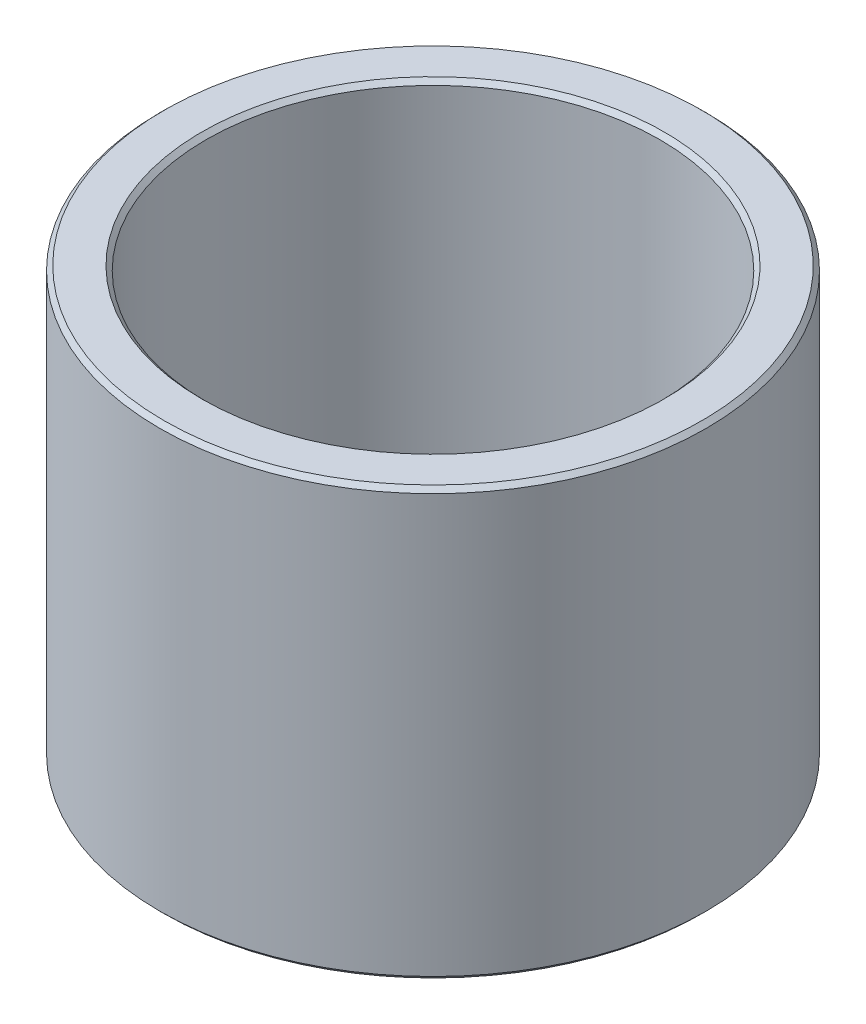
ISO-10303-21;
HEADER;
FILE_DESCRIPTION(('STEP AP214'),'2;1');
FILE_NAME('part.step','',(''),(''),'','','');
FILE_SCHEMA(('AUTOMOTIVE_DESIGN { 1 0 10303 214 1 1 1 1 }'));
ENDSEC;
DATA;
#1=APPLICATION_CONTEXT('core data for automotive mechanical design processes');
#2=APPLICATION_PROTOCOL_DEFINITION('international standard','automotive_design',2000,#1);
#3=PRODUCT_CONTEXT('',#1,'mechanical');
#4=PRODUCT('Part','Part','',(#3));
#5=PRODUCT_RELATED_PRODUCT_CATEGORY('part','',(#4));
#6=PRODUCT_DEFINITION_FORMATION('','',#4);
#7=PRODUCT_DEFINITION_CONTEXT('part definition',#1,'design');
#8=PRODUCT_DEFINITION('design','',#6,#7);
#9=PRODUCT_DEFINITION_SHAPE('','',#8);
#10=(LENGTH_UNIT() NAMED_UNIT(*) SI_UNIT(.MILLI.,.METRE.));
#11=(NAMED_UNIT(*) PLANE_ANGLE_UNIT() SI_UNIT($,.RADIAN.));
#12=(NAMED_UNIT(*) SI_UNIT($,.STERADIAN.) SOLID_ANGLE_UNIT());
#13=UNCERTAINTY_MEASURE_WITH_UNIT(LENGTH_MEASURE(1.E-05),#10,'distance_accuracy_value','');
#14=(GEOMETRIC_REPRESENTATION_CONTEXT(3) GLOBAL_UNCERTAINTY_ASSIGNED_CONTEXT((#13)) GLOBAL_UNIT_ASSIGNED_CONTEXT((#10,
#11,#12)) REPRESENTATION_CONTEXT('',''));
#15=CARTESIAN_POINT('',(0.,0.,0.));
#16=DIRECTION('',(0.,0.,1.));
#17=DIRECTION('',(1.,0.,0.));
#18=AXIS2_PLACEMENT_3D('',#15,#16,#17);
#19=CARTESIAN_POINT('',(0.,66.3926313848611,0.));
#20=DIRECTION('',(0.,-1.,0.));
#21=DIRECTION('',(0.,0.,-1.));
#22=AXIS2_PLACEMENT_3D('',#19,#20,#21);
#23=CYLINDRICAL_SURFACE('',#22,42.5);
#24=CARTESIAN_POINT('',(0.,0.686489548159461,0.));
#25=DIRECTION('',(0.,1.,0.));
#26=DIRECTION('',(0.,0.,1.));
#27=AXIS2_PLACEMENT_3D('',#24,#25,#26);
#28=CIRCLE('',#27,42.5);
#29=CARTESIAN_POINT('',(0.,0.686489548159461,42.5));
#30=VERTEX_POINT('',#29);
#31=EDGE_CURVE('E10',#30,#30,#28,.T.);
#32=ORIENTED_EDGE('',*,*,#31,.T.);
#33=EDGE_LOOP('',(#32));
#34=FACE_BOUND('',#33,.T.);
#35=CARTESIAN_POINT('',(0.,65.7061418367016,0.));
#36=DIRECTION('',(0.,1.,0.));
#37=DIRECTION('',(0.,0.,1.));
#38=AXIS2_PLACEMENT_3D('',#35,#36,#37);
#39=CIRCLE('',#38,42.5);
#40=CARTESIAN_POINT('',(0.,65.7061418367016,42.5));
#41=VERTEX_POINT('',#40);
#42=EDGE_CURVE('E50',#41,#41,#39,.F.);
#43=ORIENTED_EDGE('',*,*,#42,.T.);
#44=EDGE_LOOP('',(#43));
#45=FACE_BOUND('',#44,.T.);
#46=ADVANCED_FACE('F39',(#34,#45),#23,.T.);
#47=CARTESIAN_POINT('',(0.,66.3926313848611,0.));
#48=DIRECTION('',(0.,1.,0.));
#49=DIRECTION('',(0.,0.,1.));
#50=AXIS2_PLACEMENT_3D('',#47,#48,#49);
#51=PLANE('',#50);
#52=CARTESIAN_POINT('',(0.,66.3926313848611,0.));
#53=DIRECTION('',(0.,1.,0.));
#54=DIRECTION('',(0.,0.,1.));
#55=AXIS2_PLACEMENT_3D('',#52,#53,#54);
#56=CIRCLE('',#55,35.9613486154048);
#57=CARTESIAN_POINT('',(0.,66.3926313848611,35.9613486154048));
#58=VERTEX_POINT('',#57);
#59=EDGE_CURVE('E58',#58,#58,#56,.F.);
#60=ORIENTED_EDGE('',*,*,#59,.T.);
#61=EDGE_LOOP('',(#60));
#62=FACE_BOUND('',#61,.T.);
#63=CARTESIAN_POINT('',(0.,66.3926313848611,0.));
#64=DIRECTION('',(0.,1.,0.));
#65=DIRECTION('',(0.,0.,1.));
#66=AXIS2_PLACEMENT_3D('',#63,#64,#65);
#67=CIRCLE('',#66,41.8135104518405);
#68=CARTESIAN_POINT('',(0.,66.3926313848611,41.8135104518405));
#69=VERTEX_POINT('',#68);
#70=EDGE_CURVE('E61',#69,#69,#67,.T.);
#71=ORIENTED_EDGE('',*,*,#70,.T.);
#72=EDGE_LOOP('',(#71));
#73=FACE_BOUND('',#72,.T.);
#74=ADVANCED_FACE('F88',(#62,#73),#51,.T.);
#75=CARTESIAN_POINT('',(0.,0.,0.));
#76=DIRECTION('',(0.,1.,0.));
#77=DIRECTION('',(0.,0.,1.));
#78=AXIS2_PLACEMENT_3D('',#75,#76,#77);
#79=PLANE('',#78);
#80=CARTESIAN_POINT('',(0.,0.,0.));
#81=DIRECTION('',(0.,1.,0.));
#82=DIRECTION('',(0.,0.,1.));
#83=AXIS2_PLACEMENT_3D('',#80,#81,#82);
#84=CIRCLE('',#83,35.9613486154048);
#85=CARTESIAN_POINT('',(0.,0.,35.9613486154048));
#86=VERTEX_POINT('',#85);
#87=EDGE_CURVE('E51',#86,#86,#84,.T.);
#88=ORIENTED_EDGE('',*,*,#87,.T.);
#89=EDGE_LOOP('',(#88));
#90=FACE_BOUND('',#89,.T.);
#91=CARTESIAN_POINT('',(0.,0.,0.));
#92=DIRECTION('',(0.,1.,0.));
#93=DIRECTION('',(0.,0.,1.));
#94=AXIS2_PLACEMENT_3D('',#91,#92,#93);
#95=CIRCLE('',#94,41.8135104518405);
#96=CARTESIAN_POINT('',(0.,0.,41.8135104518405));
#97=VERTEX_POINT('',#96);
#98=EDGE_CURVE('E54',#97,#97,#95,.F.);
#99=ORIENTED_EDGE('',*,*,#98,.T.);
#100=EDGE_LOOP('',(#99));
#101=FACE_BOUND('',#100,.T.);
#102=ADVANCED_FACE('F83',(#90,#101),#79,.F.);
#103=CARTESIAN_POINT('',(0.,66.3926313848611,0.));
#104=DIRECTION('',(0.,-1.,0.));
#105=DIRECTION('',(0.,0.,-1.));
#106=AXIS2_PLACEMENT_3D('',#103,#104,#105);
#107=CYLINDRICAL_SURFACE('',#106,35.2748590672454);
#108=CARTESIAN_POINT('',(0.,65.7061418367017,0.));
#109=DIRECTION('',(0.,1.,0.));
#110=DIRECTION('',(0.,0.,1.));
#111=AXIS2_PLACEMENT_3D('',#108,#109,#110);
#112=CIRCLE('',#111,35.2748590672454);
#113=CARTESIAN_POINT('',(0.,65.7061418367017,35.2748590672454));
#114=VERTEX_POINT('',#113);
#115=EDGE_CURVE('E67',#114,#114,#112,.T.);
#116=ORIENTED_EDGE('',*,*,#115,.T.);
#117=EDGE_LOOP('',(#116));
#118=FACE_BOUND('',#117,.T.);
#119=CARTESIAN_POINT('',(0.,0.686489548159461,0.));
#120=DIRECTION('',(0.,1.,0.));
#121=DIRECTION('',(0.,0.,1.));
#122=AXIS2_PLACEMENT_3D('',#119,#120,#121);
#123=CIRCLE('',#122,35.2748590672454);
#124=CARTESIAN_POINT('',(0.,0.686489548159461,35.2748590672454));
#125=VERTEX_POINT('',#124);
#126=EDGE_CURVE('E69',#125,#125,#123,.F.);
#127=ORIENTED_EDGE('',*,*,#126,.T.);
#128=EDGE_LOOP('',(#127));
#129=FACE_BOUND('',#128,.T.);
#130=ADVANCED_FACE('F71',(#118,#129),#107,.F.);
#131=CARTESIAN_POINT('',(0.,65.7061418367017,0.));
#132=DIRECTION('',(0.,1.,0.));
#133=DIRECTION('',(0.,0.,1.));
#134=AXIS2_PLACEMENT_3D('',#131,#132,#133);
#135=CONICAL_SURFACE('',#134,35.2748590672454,0.785398163397453);
#136=ORIENTED_EDGE('',*,*,#59,.F.);
#137=EDGE_LOOP('',(#136));
#138=FACE_BOUND('',#137,.T.);
#139=ORIENTED_EDGE('',*,*,#115,.F.);
#140=EDGE_LOOP('',(#139));
#141=FACE_BOUND('',#140,.T.);
#142=ADVANCED_FACE('F77',(#138,#141),#135,.F.);
#143=CARTESIAN_POINT('',(0.,0.,0.));
#144=DIRECTION('',(0.,-1.,0.));
#145=DIRECTION('',(0.,0.,-1.));
#146=AXIS2_PLACEMENT_3D('',#143,#144,#145);
#147=CONICAL_SURFACE('',#146,35.9613486154048,0.785398163397448);
#148=ORIENTED_EDGE('',*,*,#126,.F.);
#149=EDGE_LOOP('',(#148));
#150=FACE_BOUND('',#149,.T.);
#151=ORIENTED_EDGE('',*,*,#87,.F.);
#152=EDGE_LOOP('',(#151));
#153=FACE_BOUND('',#152,.T.);
#154=ADVANCED_FACE('F73',(#150,#153),#147,.F.);
#155=CARTESIAN_POINT('',(0.,0.686489548159461,0.));
#156=DIRECTION('',(0.,1.,0.));
#157=DIRECTION('',(0.,0.,1.));
#158=AXIS2_PLACEMENT_3D('',#155,#156,#157);
#159=CONICAL_SURFACE('',#158,42.5,0.785398163397453);
#160=ORIENTED_EDGE('',*,*,#98,.F.);
#161=EDGE_LOOP('',(#160));
#162=FACE_BOUND('',#161,.T.);
#163=ORIENTED_EDGE('',*,*,#31,.F.);
#164=EDGE_LOOP('',(#163));
#165=FACE_BOUND('',#164,.T.);
#166=ADVANCED_FACE('F76',(#162,#165),#159,.T.);
#167=CARTESIAN_POINT('',(0.,66.3926313848611,0.));
#168=DIRECTION('',(0.,-1.,0.));
#169=DIRECTION('',(0.,0.,-1.));
#170=AXIS2_PLACEMENT_3D('',#167,#168,#169);
#171=CONICAL_SURFACE('',#170,41.8135104518405,0.785398163397448);
#172=ORIENTED_EDGE('',*,*,#42,.F.);
#173=EDGE_LOOP('',(#172));
#174=FACE_BOUND('',#173,.T.);
#175=ORIENTED_EDGE('',*,*,#70,.F.);
#176=EDGE_LOOP('',(#175));
#177=FACE_BOUND('',#176,.T.);
#178=ADVANCED_FACE('F45',(#174,#177),#171,.T.);
#179=CLOSED_SHELL('',(#46,#74,#102,#130,#142,#154,#166,#178));
#180=MANIFOLD_SOLID_BREP('B2',#179);
#181=ADVANCED_BREP_SHAPE_REPRESENTATION('',(#18,#180),#14);
#182=SHAPE_DEFINITION_REPRESENTATION(#9,#181);
ENDSEC;
END-ISO-10303-21;
